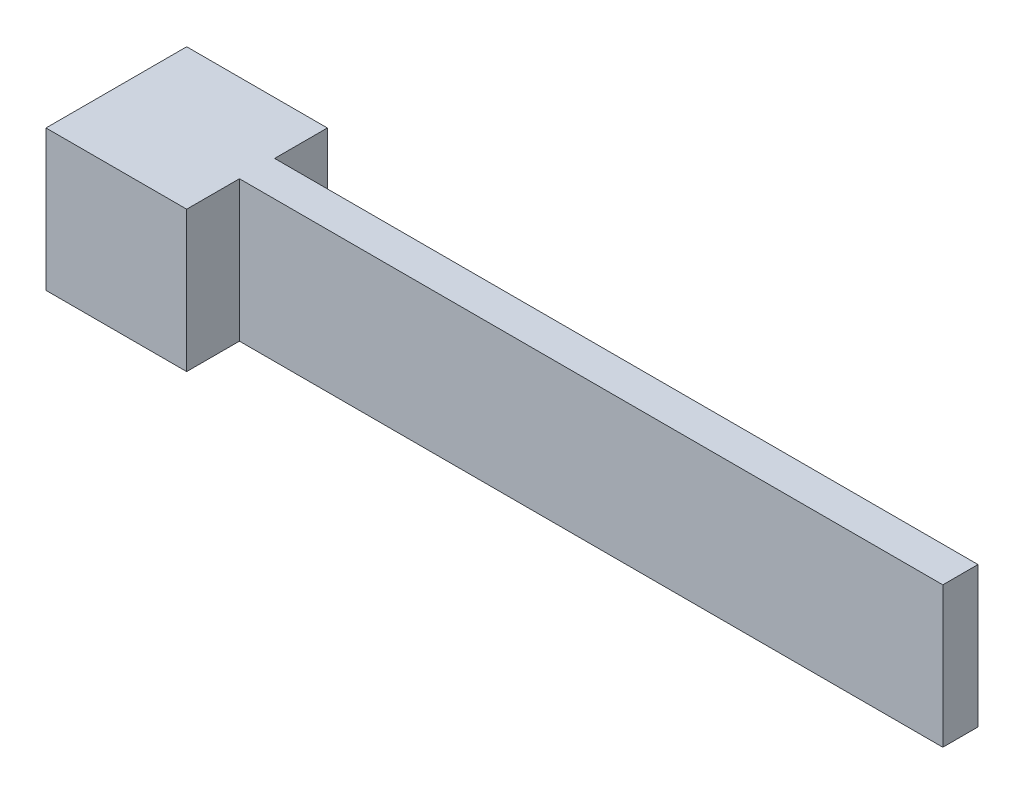
ISO-10303-21;
HEADER;
FILE_DESCRIPTION(('STEP AP214'),'2;1');
FILE_NAME('part.step','',(''),(''),'','','');
FILE_SCHEMA(('AUTOMOTIVE_DESIGN { 1 0 10303 214 1 1 1 1 }'));
ENDSEC;
DATA;
#1=APPLICATION_CONTEXT('core data for automotive mechanical design processes');
#2=APPLICATION_PROTOCOL_DEFINITION('international standard','automotive_design',2000,#1);
#3=PRODUCT_CONTEXT('',#1,'mechanical');
#4=PRODUCT('Part','Part','',(#3));
#5=PRODUCT_RELATED_PRODUCT_CATEGORY('part','',(#4));
#6=PRODUCT_DEFINITION_FORMATION('','',#4);
#7=PRODUCT_DEFINITION_CONTEXT('part definition',#1,'design');
#8=PRODUCT_DEFINITION('design','',#6,#7);
#9=PRODUCT_DEFINITION_SHAPE('','',#8);
#10=(LENGTH_UNIT() NAMED_UNIT(*) SI_UNIT(.MILLI.,.METRE.));
#11=(NAMED_UNIT(*) PLANE_ANGLE_UNIT() SI_UNIT($,.RADIAN.));
#12=(NAMED_UNIT(*) SI_UNIT($,.STERADIAN.) SOLID_ANGLE_UNIT());
#13=UNCERTAINTY_MEASURE_WITH_UNIT(LENGTH_MEASURE(1.E-05),#10,'distance_accuracy_value','');
#14=(GEOMETRIC_REPRESENTATION_CONTEXT(3) GLOBAL_UNCERTAINTY_ASSIGNED_CONTEXT((#13)) GLOBAL_UNIT_ASSIGNED_CONTEXT((#10,
#11,#12)) REPRESENTATION_CONTEXT('',''));
#15=CARTESIAN_POINT('',(0.,0.,0.));
#16=DIRECTION('',(0.,0.,1.));
#17=DIRECTION('',(1.,0.,0.));
#18=AXIS2_PLACEMENT_3D('',#15,#16,#17);
#19=CARTESIAN_POINT('',(6.,0.,0.));
#20=DIRECTION('',(-1.,0.,0.));
#21=DIRECTION('',(0.,0.,1.));
#22=AXIS2_PLACEMENT_3D('',#19,#20,#21);
#23=PLANE('',#22);
#24=DIRECTION('',(0.,1.,0.));
#25=VECTOR('',#24,1.);
#26=CARTESIAN_POINT('',(6.,-3.,-0.75));
#27=LINE('',#26,#25);
#28=CARTESIAN_POINT('',(6.,-3.,-0.75));
#29=VERTEX_POINT('',#28);
#30=CARTESIAN_POINT('',(6.,3.,-0.75));
#31=VERTEX_POINT('',#30);
#32=EDGE_CURVE('E49',#29,#31,#27,.T.);
#33=ORIENTED_EDGE('',*,*,#32,.F.);
#34=DIRECTION('',(0.,0.,-1.));
#35=VECTOR('',#34,1.);
#36=CARTESIAN_POINT('',(6.,-3.,3.));
#37=LINE('',#36,#35);
#38=CARTESIAN_POINT('',(6.,-3.,-3.));
#39=VERTEX_POINT('',#38);
#40=EDGE_CURVE('E146',#29,#39,#37,.T.);
#41=ORIENTED_EDGE('',*,*,#40,.T.);
#42=DIRECTION('',(0.,1.,0.));
#43=VECTOR('',#42,1.);
#44=CARTESIAN_POINT('',(6.,-3.,-3.));
#45=LINE('',#44,#43);
#46=CARTESIAN_POINT('',(6.,3.,-3.));
#47=VERTEX_POINT('',#46);
#48=EDGE_CURVE('E141',#39,#47,#45,.T.);
#49=ORIENTED_EDGE('',*,*,#48,.T.);
#50=DIRECTION('',(0.,0.,1.));
#51=VECTOR('',#50,1.);
#52=CARTESIAN_POINT('',(6.,3.,3.));
#53=LINE('',#52,#51);
#54=EDGE_CURVE('E196',#47,#31,#53,.T.);
#55=ORIENTED_EDGE('',*,*,#54,.T.);
#56=EDGE_LOOP('',(#33,#41,#49,#55));
#57=FACE_BOUND('',#56,.T.);
#58=ADVANCED_FACE('F32',(#57),#23,.F.);
#59=DIRECTION('',(0.,-1.,0.));
#60=VECTOR('',#59,1.);
#61=CARTESIAN_POINT('',(6.,-3.,0.75));
#62=LINE('',#61,#60);
#63=CARTESIAN_POINT('',(6.,3.,0.75));
#64=VERTEX_POINT('',#63);
#65=CARTESIAN_POINT('',(6.,-3.,0.75));
#66=VERTEX_POINT('',#65);
#67=EDGE_CURVE('E57',#64,#66,#62,.T.);
#68=ORIENTED_EDGE('',*,*,#67,.F.);
#69=CARTESIAN_POINT('',(6.,3.,3.));
#70=VERTEX_POINT('',#69);
#71=EDGE_CURVE('E199',#64,#70,#53,.T.);
#72=ORIENTED_EDGE('',*,*,#71,.T.);
#73=DIRECTION('',(0.,-1.,0.));
#74=VECTOR('',#73,1.);
#75=CARTESIAN_POINT('',(6.,-3.,3.));
#76=LINE('',#75,#74);
#77=CARTESIAN_POINT('',(6.,-3.,3.));
#78=VERTEX_POINT('',#77);
#79=EDGE_CURVE('E198',#70,#78,#76,.T.);
#80=ORIENTED_EDGE('',*,*,#79,.T.);
#81=EDGE_CURVE('E187',#78,#66,#37,.T.);
#82=ORIENTED_EDGE('',*,*,#81,.T.);
#83=EDGE_LOOP('',(#68,#72,#80,#82));
#84=FACE_BOUND('',#83,.T.);
#85=ADVANCED_FACE('F210',(#84),#23,.F.);
#86=CARTESIAN_POINT('',(6.,-3.,-3.));
#87=DIRECTION('',(0.,0.,1.));
#88=DIRECTION('',(1.,0.,0.));
#89=AXIS2_PLACEMENT_3D('',#86,#87,#88);
#90=PLANE('',#89);
#91=DIRECTION('',(0.,1.,0.));
#92=VECTOR('',#91,1.);
#93=CARTESIAN_POINT('',(0.,-3.,-3.));
#94=LINE('',#93,#92);
#95=CARTESIAN_POINT('',(0.,-3.,-3.));
#96=VERTEX_POINT('',#95);
#97=CARTESIAN_POINT('',(0.,3.,-3.));
#98=VERTEX_POINT('',#97);
#99=EDGE_CURVE('E120',#96,#98,#94,.T.);
#100=ORIENTED_EDGE('',*,*,#99,.T.);
#101=DIRECTION('',(-1.,0.,0.));
#102=VECTOR('',#101,1.);
#103=CARTESIAN_POINT('',(6.,3.,-3.));
#104=LINE('',#103,#102);
#105=EDGE_CURVE('E11',#47,#98,#104,.T.);
#106=ORIENTED_EDGE('',*,*,#105,.F.);
#107=ORIENTED_EDGE('',*,*,#48,.F.);
#108=DIRECTION('',(-1.,0.,0.));
#109=VECTOR('',#108,1.);
#110=CARTESIAN_POINT('',(6.,-3.,-3.));
#111=LINE('',#110,#109);
#112=EDGE_CURVE('E184',#39,#96,#111,.T.);
#113=ORIENTED_EDGE('',*,*,#112,.T.);
#114=EDGE_LOOP('',(#100,#106,#107,#113));
#115=FACE_BOUND('',#114,.T.);
#116=ADVANCED_FACE('F34',(#115),#90,.F.);
#117=CARTESIAN_POINT('',(6.,3.,3.));
#118=DIRECTION('',(0.,-1.,0.));
#119=DIRECTION('',(0.,0.,-1.));
#120=AXIS2_PLACEMENT_3D('',#117,#118,#119);
#121=PLANE('',#120);
#122=DIRECTION('',(0.,0.,1.));
#123=VECTOR('',#122,1.);
#124=CARTESIAN_POINT('',(0.,3.,3.));
#125=LINE('',#124,#123);
#126=CARTESIAN_POINT('',(0.,3.,3.));
#127=VERTEX_POINT('',#126);
#128=EDGE_CURVE('E123',#98,#127,#125,.T.);
#129=ORIENTED_EDGE('',*,*,#128,.T.);
#130=DIRECTION('',(-1.,0.,0.));
#131=VECTOR('',#130,1.);
#132=CARTESIAN_POINT('',(6.,3.,3.));
#133=LINE('',#132,#131);
#134=EDGE_CURVE('E41',#70,#127,#133,.T.);
#135=ORIENTED_EDGE('',*,*,#134,.F.);
#136=ORIENTED_EDGE('',*,*,#71,.F.);
#137=DIRECTION('',(-1.,0.,0.));
#138=VECTOR('',#137,1.);
#139=CARTESIAN_POINT('',(36.,3.,0.75));
#140=LINE('',#139,#138);
#141=CARTESIAN_POINT('',(36.,3.,0.75));
#142=VERTEX_POINT('',#141);
#143=EDGE_CURVE('E105',#142,#64,#140,.T.);
#144=ORIENTED_EDGE('',*,*,#143,.F.);
#145=DIRECTION('',(0.,0.,1.));
#146=VECTOR('',#145,1.);
#147=CARTESIAN_POINT('',(36.,3.,0.75));
#148=LINE('',#147,#146);
#149=CARTESIAN_POINT('',(36.,3.,-0.75));
#150=VERTEX_POINT('',#149);
#151=EDGE_CURVE('E99',#150,#142,#148,.T.);
#152=ORIENTED_EDGE('',*,*,#151,.F.);
#153=DIRECTION('',(-1.,0.,0.));
#154=VECTOR('',#153,1.);
#155=CARTESIAN_POINT('',(36.,3.,-0.75));
#156=LINE('',#155,#154);
#157=EDGE_CURVE('E103',#150,#31,#156,.T.);
#158=ORIENTED_EDGE('',*,*,#157,.T.);
#159=ORIENTED_EDGE('',*,*,#54,.F.);
#160=ORIENTED_EDGE('',*,*,#105,.T.);
#161=EDGE_LOOP('',(#129,#135,#136,#144,#152,#158,#159,#160));
#162=FACE_BOUND('',#161,.T.);
#163=ADVANCED_FACE('F101',(#162),#121,.F.);
#164=CARTESIAN_POINT('',(6.,-3.,3.));
#165=DIRECTION('',(0.,0.,-1.));
#166=DIRECTION('',(-1.,0.,0.));
#167=AXIS2_PLACEMENT_3D('',#164,#165,#166);
#168=PLANE('',#167);
#169=DIRECTION('',(0.,-1.,0.));
#170=VECTOR('',#169,1.);
#171=CARTESIAN_POINT('',(0.,-3.,3.));
#172=LINE('',#171,#170);
#173=CARTESIAN_POINT('',(0.,-3.,3.));
#174=VERTEX_POINT('',#173);
#175=EDGE_CURVE('E206',#127,#174,#172,.T.);
#176=ORIENTED_EDGE('',*,*,#175,.T.);
#177=DIRECTION('',(-1.,0.,0.));
#178=VECTOR('',#177,1.);
#179=CARTESIAN_POINT('',(6.,-3.,3.));
#180=LINE('',#179,#178);
#181=EDGE_CURVE('E186',#78,#174,#180,.T.);
#182=ORIENTED_EDGE('',*,*,#181,.F.);
#183=ORIENTED_EDGE('',*,*,#79,.F.);
#184=ORIENTED_EDGE('',*,*,#134,.T.);
#185=EDGE_LOOP('',(#176,#182,#183,#184));
#186=FACE_BOUND('',#185,.T.);
#187=ADVANCED_FACE('F212',(#186),#168,.F.);
#188=CARTESIAN_POINT('',(6.,-3.,3.));
#189=DIRECTION('',(0.,1.,0.));
#190=DIRECTION('',(0.,0.,1.));
#191=AXIS2_PLACEMENT_3D('',#188,#189,#190);
#192=PLANE('',#191);
#193=DIRECTION('',(0.,0.,-1.));
#194=VECTOR('',#193,1.);
#195=CARTESIAN_POINT('',(0.,-3.,3.));
#196=LINE('',#195,#194);
#197=EDGE_CURVE('E178',#174,#96,#196,.T.);
#198=ORIENTED_EDGE('',*,*,#197,.T.);
#199=ORIENTED_EDGE('',*,*,#112,.F.);
#200=ORIENTED_EDGE('',*,*,#40,.F.);
#201=DIRECTION('',(-1.,0.,0.));
#202=VECTOR('',#201,1.);
#203=CARTESIAN_POINT('',(36.,-3.,-0.75));
#204=LINE('',#203,#202);
#205=CARTESIAN_POINT('',(36.,-3.,-0.75));
#206=VERTEX_POINT('',#205);
#207=EDGE_CURVE('E134',#206,#29,#204,.T.);
#208=ORIENTED_EDGE('',*,*,#207,.F.);
#209=DIRECTION('',(0.,0.,-1.));
#210=VECTOR('',#209,1.);
#211=CARTESIAN_POINT('',(36.,-3.,0.75));
#212=LINE('',#211,#210);
#213=CARTESIAN_POINT('',(36.,-3.,0.75));
#214=VERTEX_POINT('',#213);
#215=EDGE_CURVE('E114',#214,#206,#212,.T.);
#216=ORIENTED_EDGE('',*,*,#215,.F.);
#217=DIRECTION('',(-1.,0.,0.));
#218=VECTOR('',#217,1.);
#219=CARTESIAN_POINT('',(36.,-3.,0.75));
#220=LINE('',#219,#218);
#221=EDGE_CURVE('E125',#214,#66,#220,.T.);
#222=ORIENTED_EDGE('',*,*,#221,.T.);
#223=ORIENTED_EDGE('',*,*,#81,.F.);
#224=ORIENTED_EDGE('',*,*,#181,.T.);
#225=EDGE_LOOP('',(#198,#199,#200,#208,#216,#222,#223,#224));
#226=FACE_BOUND('',#225,.T.);
#227=ADVANCED_FACE('F173',(#226),#192,.F.);
#228=CARTESIAN_POINT('',(0.,0.,0.));
#229=DIRECTION('',(-1.,0.,0.));
#230=DIRECTION('',(0.,0.,1.));
#231=AXIS2_PLACEMENT_3D('',#228,#229,#230);
#232=PLANE('',#231);
#233=CARTESIAN_POINT('',(0.,0.,0.));
#234=DIRECTION('',(-1.,0.,0.));
#235=DIRECTION('',(0.,0.,1.));
#236=AXIS2_PLACEMENT_3D('',#233,#234,#235);
#237=CIRCLE('',#236,1.5);
#238=CARTESIAN_POINT('',(0.,0.,1.5));
#239=VERTEX_POINT('',#238);
#240=EDGE_CURVE('E156',#239,#239,#237,.T.);
#241=ORIENTED_EDGE('',*,*,#240,.F.);
#242=EDGE_LOOP('',(#241));
#243=FACE_BOUND('',#242,.T.);
#244=ORIENTED_EDGE('',*,*,#99,.F.);
#245=ORIENTED_EDGE('',*,*,#197,.F.);
#246=ORIENTED_EDGE('',*,*,#175,.F.);
#247=ORIENTED_EDGE('',*,*,#128,.F.);
#248=EDGE_LOOP('',(#244,#245,#246,#247));
#249=FACE_BOUND('',#248,.T.);
#250=ADVANCED_FACE('F170',(#243,#249),#232,.T.);
#251=CARTESIAN_POINT('',(36.,-3.,-0.75));
#252=DIRECTION('',(0.,0.,1.));
#253=DIRECTION('',(1.,0.,0.));
#254=AXIS2_PLACEMENT_3D('',#251,#252,#253);
#255=PLANE('',#254);
#256=ORIENTED_EDGE('',*,*,#32,.T.);
#257=ORIENTED_EDGE('',*,*,#157,.F.);
#258=DIRECTION('',(0.,1.,0.));
#259=VECTOR('',#258,1.);
#260=CARTESIAN_POINT('',(36.,-3.,-0.75));
#261=LINE('',#260,#259);
#262=EDGE_CURVE('E109',#206,#150,#261,.T.);
#263=ORIENTED_EDGE('',*,*,#262,.F.);
#264=ORIENTED_EDGE('',*,*,#207,.T.);
#265=EDGE_LOOP('',(#256,#257,#263,#264));
#266=FACE_BOUND('',#265,.T.);
#267=ADVANCED_FACE('F119',(#266),#255,.F.);
#268=CARTESIAN_POINT('',(36.,-3.,0.75));
#269=DIRECTION('',(0.,0.,-1.));
#270=DIRECTION('',(-1.,0.,0.));
#271=AXIS2_PLACEMENT_3D('',#268,#269,#270);
#272=PLANE('',#271);
#273=ORIENTED_EDGE('',*,*,#67,.T.);
#274=ORIENTED_EDGE('',*,*,#221,.F.);
#275=DIRECTION('',(0.,-1.,0.));
#276=VECTOR('',#275,1.);
#277=CARTESIAN_POINT('',(36.,-3.,0.75));
#278=LINE('',#277,#276);
#279=EDGE_CURVE('E108',#142,#214,#278,.T.);
#280=ORIENTED_EDGE('',*,*,#279,.F.);
#281=ORIENTED_EDGE('',*,*,#143,.T.);
#282=EDGE_LOOP('',(#273,#274,#280,#281));
#283=FACE_BOUND('',#282,.T.);
#284=ADVANCED_FACE('F214',(#283),#272,.F.);
#285=CARTESIAN_POINT('',(36.,0.,0.));
#286=DIRECTION('',(-1.,0.,0.));
#287=DIRECTION('',(0.,0.,1.));
#288=AXIS2_PLACEMENT_3D('',#285,#286,#287);
#289=PLANE('',#288);
#290=ORIENTED_EDGE('',*,*,#262,.T.);
#291=ORIENTED_EDGE('',*,*,#151,.T.);
#292=ORIENTED_EDGE('',*,*,#279,.T.);
#293=ORIENTED_EDGE('',*,*,#215,.T.);
#294=EDGE_LOOP('',(#290,#291,#292,#293));
#295=FACE_BOUND('',#294,.T.);
#296=ADVANCED_FACE('F112',(#295),#289,.F.);
#297=CARTESIAN_POINT('',(5.,0.,0.));
#298=DIRECTION('',(-1.,0.,0.));
#299=DIRECTION('',(0.,0.,1.));
#300=AXIS2_PLACEMENT_3D('',#297,#298,#299);
#301=CYLINDRICAL_SURFACE('',#300,1.5);
#302=CARTESIAN_POINT('',(5.,0.,0.));
#303=DIRECTION('',(-1.,0.,0.));
#304=DIRECTION('',(0.,0.,1.));
#305=AXIS2_PLACEMENT_3D('',#302,#303,#304);
#306=CIRCLE('',#305,1.5);
#307=CARTESIAN_POINT('',(5.,0.,1.5));
#308=VERTEX_POINT('',#307);
#309=EDGE_CURVE('E133',#308,#308,#306,.T.);
#310=ORIENTED_EDGE('',*,*,#309,.F.);
#311=EDGE_LOOP('',(#310));
#312=FACE_BOUND('',#311,.T.);
#313=ORIENTED_EDGE('',*,*,#240,.T.);
#314=EDGE_LOOP('',(#313));
#315=FACE_BOUND('',#314,.T.);
#316=ADVANCED_FACE('F164',(#312,#315),#301,.F.);
#317=CARTESIAN_POINT('',(5.,0.,0.));
#318=DIRECTION('',(-1.,0.,0.));
#319=DIRECTION('',(0.,0.,1.));
#320=AXIS2_PLACEMENT_3D('',#317,#318,#319);
#321=PLANE('',#320);
#322=ORIENTED_EDGE('',*,*,#309,.T.);
#323=EDGE_LOOP('',(#322));
#324=FACE_BOUND('',#323,.T.);
#325=ADVANCED_FACE('F162',(#324),#321,.T.);
#326=CLOSED_SHELL('',(#58,#85,#116,#163,#187,#227,#250,#267,#284,#296,#316,#325));
#327=MANIFOLD_SOLID_BREP('B2',#326);
#328=ADVANCED_BREP_SHAPE_REPRESENTATION('',(#18,#327),#14);
#329=SHAPE_DEFINITION_REPRESENTATION(#9,#328);
ENDSEC;
END-ISO-10303-21;
